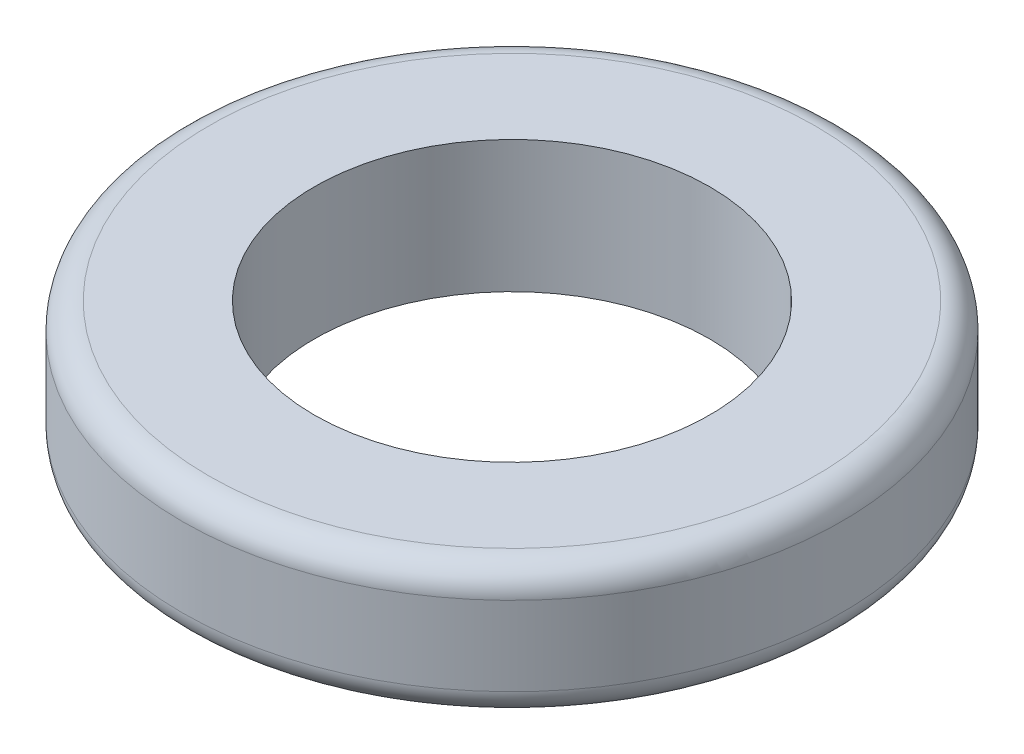
ISO-10303-21;
HEADER;
FILE_DESCRIPTION(('STEP AP214'),'2;1');
FILE_NAME('part.step','',(''),(''),'','','');
FILE_SCHEMA(('AUTOMOTIVE_DESIGN { 1 0 10303 214 1 1 1 1 }'));
ENDSEC;
DATA;
#1=APPLICATION_CONTEXT('core data for automotive mechanical design processes');
#2=APPLICATION_PROTOCOL_DEFINITION('international standard','automotive_design',2000,#1);
#3=PRODUCT_CONTEXT('',#1,'mechanical');
#4=PRODUCT('Part','Part','',(#3));
#5=PRODUCT_RELATED_PRODUCT_CATEGORY('part','',(#4));
#6=PRODUCT_DEFINITION_FORMATION('','',#4);
#7=PRODUCT_DEFINITION_CONTEXT('part definition',#1,'design');
#8=PRODUCT_DEFINITION('design','',#6,#7);
#9=PRODUCT_DEFINITION_SHAPE('','',#8);
#10=(LENGTH_UNIT() NAMED_UNIT(*) SI_UNIT(.MILLI.,.METRE.));
#11=(NAMED_UNIT(*) PLANE_ANGLE_UNIT() SI_UNIT($,.RADIAN.));
#12=(NAMED_UNIT(*) SI_UNIT($,.STERADIAN.) SOLID_ANGLE_UNIT());
#13=UNCERTAINTY_MEASURE_WITH_UNIT(LENGTH_MEASURE(1.E-05),#10,'distance_accuracy_value','');
#14=(GEOMETRIC_REPRESENTATION_CONTEXT(3) GLOBAL_UNCERTAINTY_ASSIGNED_CONTEXT((#13)) GLOBAL_UNIT_ASSIGNED_CONTEXT((#10,
#11,#12)) REPRESENTATION_CONTEXT('',''));
#15=CARTESIAN_POINT('',(0.,0.,0.));
#16=DIRECTION('',(0.,0.,1.));
#17=DIRECTION('',(1.,0.,0.));
#18=AXIS2_PLACEMENT_3D('',#15,#16,#17);
#19=CARTESIAN_POINT('',(0.,5.,0.));
#20=DIRECTION('',(0.,1.,0.));
#21=DIRECTION('',(0.,0.,1.));
#22=AXIS2_PLACEMENT_3D('',#19,#20,#21);
#23=PLANE('',#22);
#24=CARTESIAN_POINT('',(0.,5.,0.));
#25=DIRECTION('',(0.,1.,0.));
#26=DIRECTION('',(0.,0.,1.));
#27=AXIS2_PLACEMENT_3D('',#24,#25,#26);
#28=CIRCLE('',#27,11.5);
#29=CARTESIAN_POINT('',(0.,5.,11.5));
#30=VERTEX_POINT('',#29);
#31=EDGE_CURVE('E10',#30,#30,#28,.T.);
#32=ORIENTED_EDGE('',*,*,#31,.T.);
#33=EDGE_LOOP('',(#32));
#34=FACE_BOUND('',#33,.T.);
#35=CARTESIAN_POINT('',(0.,5.,0.));
#36=DIRECTION('',(0.,1.,0.));
#37=DIRECTION('',(0.,0.,1.));
#38=AXIS2_PLACEMENT_3D('',#35,#36,#37);
#39=CIRCLE('',#38,7.5);
#40=CARTESIAN_POINT('',(0.,5.,7.5));
#41=VERTEX_POINT('',#40);
#42=EDGE_CURVE('E61',#41,#41,#39,.T.);
#43=ORIENTED_EDGE('',*,*,#42,.F.);
#44=EDGE_LOOP('',(#43));
#45=FACE_BOUND('',#44,.T.);
#46=ADVANCED_FACE('F37',(#34,#45),#23,.T.);
#47=CARTESIAN_POINT('',(0.,0.,0.));
#48=DIRECTION('',(0.,1.,0.));
#49=DIRECTION('',(0.,0.,1.));
#50=AXIS2_PLACEMENT_3D('',#47,#48,#49);
#51=PLANE('',#50);
#52=CARTESIAN_POINT('',(0.,0.,0.));
#53=DIRECTION('',(0.,1.,0.));
#54=DIRECTION('',(0.,0.,1.));
#55=AXIS2_PLACEMENT_3D('',#52,#53,#54);
#56=CIRCLE('',#55,11.5);
#57=CARTESIAN_POINT('',(0.,0.,11.5));
#58=VERTEX_POINT('',#57);
#59=EDGE_CURVE('E45',#58,#58,#56,.F.);
#60=ORIENTED_EDGE('',*,*,#59,.T.);
#61=EDGE_LOOP('',(#60));
#62=FACE_BOUND('',#61,.T.);
#63=CARTESIAN_POINT('',(0.,0.,0.));
#64=DIRECTION('',(0.,1.,0.));
#65=DIRECTION('',(0.,0.,1.));
#66=AXIS2_PLACEMENT_3D('',#63,#64,#65);
#67=CIRCLE('',#66,7.5);
#68=CARTESIAN_POINT('',(0.,0.,7.5));
#69=VERTEX_POINT('',#68);
#70=EDGE_CURVE('E62',#69,#69,#67,.T.);
#71=ORIENTED_EDGE('',*,*,#70,.T.);
#72=EDGE_LOOP('',(#71));
#73=FACE_BOUND('',#72,.T.);
#74=ADVANCED_FACE('F74',(#62,#73),#51,.F.);
#75=CARTESIAN_POINT('',(0.,5.,0.));
#76=DIRECTION('',(0.,-1.,0.));
#77=DIRECTION('',(0.,0.,-1.));
#78=AXIS2_PLACEMENT_3D('',#75,#76,#77);
#79=CYLINDRICAL_SURFACE('',#78,12.5);
#80=CARTESIAN_POINT('',(0.,1.,0.));
#81=DIRECTION('',(0.,1.,0.));
#82=DIRECTION('',(0.,0.,1.));
#83=AXIS2_PLACEMENT_3D('',#80,#81,#82);
#84=CIRCLE('',#83,12.5);
#85=CARTESIAN_POINT('',(0.,1.,12.5));
#86=VERTEX_POINT('',#85);
#87=EDGE_CURVE('E50',#86,#86,#84,.T.);
#88=ORIENTED_EDGE('',*,*,#87,.T.);
#89=EDGE_LOOP('',(#88));
#90=FACE_BOUND('',#89,.T.);
#91=CARTESIAN_POINT('',(0.,4.,0.));
#92=DIRECTION('',(0.,1.,0.));
#93=DIRECTION('',(0.,0.,1.));
#94=AXIS2_PLACEMENT_3D('',#91,#92,#93);
#95=CIRCLE('',#94,12.5);
#96=CARTESIAN_POINT('',(0.,4.,12.5));
#97=VERTEX_POINT('',#96);
#98=EDGE_CURVE('E55',#97,#97,#95,.F.);
#99=ORIENTED_EDGE('',*,*,#98,.T.);
#100=EDGE_LOOP('',(#99));
#101=FACE_BOUND('',#100,.T.);
#102=ADVANCED_FACE('F79',(#90,#101),#79,.T.);
#103=CARTESIAN_POINT('',(0.,5.,0.));
#104=DIRECTION('',(0.,-1.,0.));
#105=DIRECTION('',(0.,0.,-1.));
#106=AXIS2_PLACEMENT_3D('',#103,#104,#105);
#107=CYLINDRICAL_SURFACE('',#106,7.5);
#108=ORIENTED_EDGE('',*,*,#42,.T.);
#109=EDGE_LOOP('',(#108));
#110=FACE_BOUND('',#109,.T.);
#111=ORIENTED_EDGE('',*,*,#70,.F.);
#112=EDGE_LOOP('',(#111));
#113=FACE_BOUND('',#112,.T.);
#114=ADVANCED_FACE('F70',(#110,#113),#107,.F.);
#115=CARTESIAN_POINT('',(0.,1.,0.));
#116=DIRECTION('',(0.,1.,0.));
#117=DIRECTION('',(0.,0.,1.));
#118=AXIS2_PLACEMENT_3D('',#115,#116,#117);
#119=TOROIDAL_SURFACE('',#118,11.5,1.);
#120=ORIENTED_EDGE('',*,*,#59,.F.);
#121=EDGE_LOOP('',(#120));
#122=FACE_BOUND('',#121,.T.);
#123=ORIENTED_EDGE('',*,*,#87,.F.);
#124=EDGE_LOOP('',(#123));
#125=FACE_BOUND('',#124,.T.);
#126=ADVANCED_FACE('F85',(#122,#125),#119,.T.);
#127=CARTESIAN_POINT('',(0.,4.,0.));
#128=DIRECTION('',(0.,1.,0.));
#129=DIRECTION('',(0.,0.,1.));
#130=AXIS2_PLACEMENT_3D('',#127,#128,#129);
#131=TOROIDAL_SURFACE('',#130,11.5,1.);
#132=ORIENTED_EDGE('',*,*,#98,.F.);
#133=EDGE_LOOP('',(#132));
#134=FACE_BOUND('',#133,.T.);
#135=ORIENTED_EDGE('',*,*,#31,.F.);
#136=EDGE_LOOP('',(#135));
#137=FACE_BOUND('',#136,.T.);
#138=ADVANCED_FACE('F39',(#134,#137),#131,.T.);
#139=CLOSED_SHELL('',(#46,#74,#102,#114,#126,#138));
#140=MANIFOLD_SOLID_BREP('B2',#139);
#141=ADVANCED_BREP_SHAPE_REPRESENTATION('',(#18,#140),#14);
#142=SHAPE_DEFINITION_REPRESENTATION(#9,#141);
ENDSEC;
END-ISO-10303-21;
